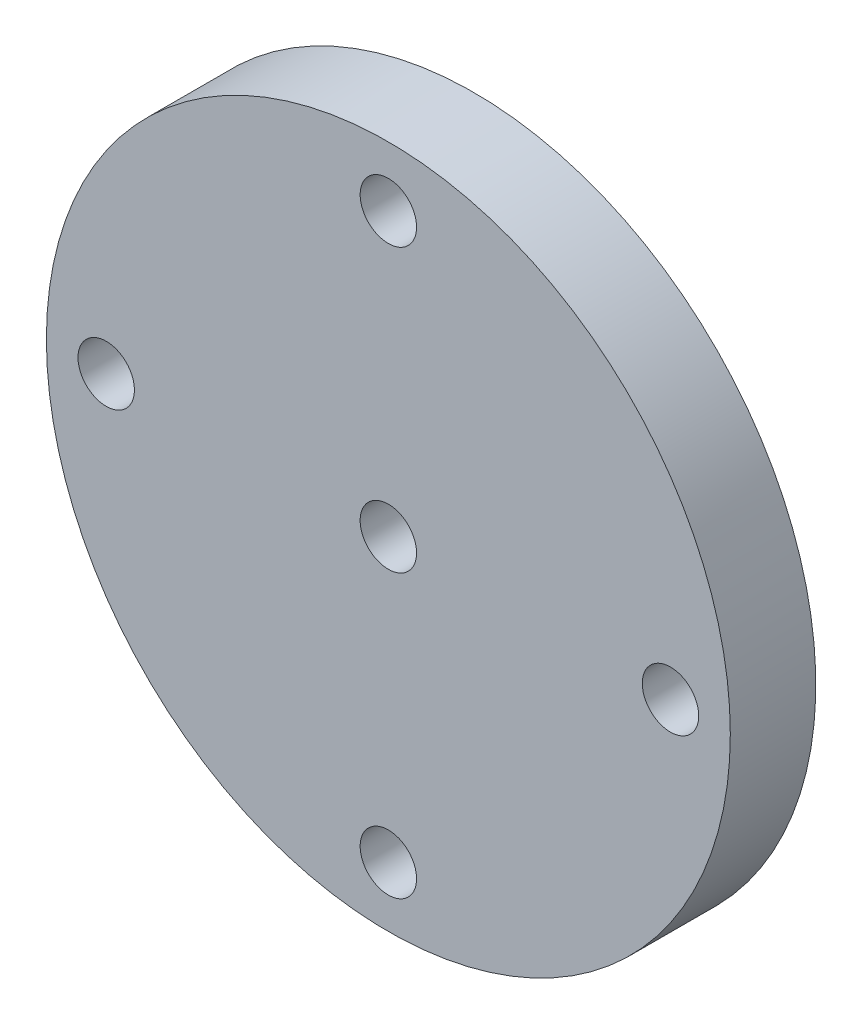
ISO-10303-21;
HEADER;
FILE_DESCRIPTION(('STEP AP214'),'2;1');
FILE_NAME('part.step','',(''),(''),'','','');
FILE_SCHEMA(('AUTOMOTIVE_DESIGN { 1 0 10303 214 1 1 1 1 }'));
ENDSEC;
DATA;
#1=APPLICATION_CONTEXT('core data for automotive mechanical design processes');
#2=APPLICATION_PROTOCOL_DEFINITION('international standard','automotive_design',2000,#1);
#3=PRODUCT_CONTEXT('',#1,'mechanical');
#4=PRODUCT('Part','Part','',(#3));
#5=PRODUCT_RELATED_PRODUCT_CATEGORY('part','',(#4));
#6=PRODUCT_DEFINITION_FORMATION('','',#4);
#7=PRODUCT_DEFINITION_CONTEXT('part definition',#1,'design');
#8=PRODUCT_DEFINITION('design','',#6,#7);
#9=PRODUCT_DEFINITION_SHAPE('','',#8);
#10=(LENGTH_UNIT() NAMED_UNIT(*) SI_UNIT(.MILLI.,.METRE.));
#11=(NAMED_UNIT(*) PLANE_ANGLE_UNIT() SI_UNIT($,.RADIAN.));
#12=(NAMED_UNIT(*) SI_UNIT($,.STERADIAN.) SOLID_ANGLE_UNIT());
#13=UNCERTAINTY_MEASURE_WITH_UNIT(LENGTH_MEASURE(1.E-05),#10,'distance_accuracy_value','');
#14=(GEOMETRIC_REPRESENTATION_CONTEXT(3) GLOBAL_UNCERTAINTY_ASSIGNED_CONTEXT((#13)) GLOBAL_UNIT_ASSIGNED_CONTEXT((#10,
#11,#12)) REPRESENTATION_CONTEXT('',''));
#15=CARTESIAN_POINT('',(0.,0.,0.));
#16=DIRECTION('',(0.,0.,1.));
#17=DIRECTION('',(1.,0.,0.));
#18=AXIS2_PLACEMENT_3D('',#15,#16,#17);
#19=CARTESIAN_POINT('',(0.,0.,10.));
#20=DIRECTION('',(0.,0.,-1.));
#21=DIRECTION('',(-1.,0.,0.));
#22=AXIS2_PLACEMENT_3D('',#19,#20,#21);
#23=CYLINDRICAL_SURFACE('',#22,20.);
#24=CARTESIAN_POINT('',(0.,0.,10.));
#25=DIRECTION('',(0.,0.,1.));
#26=DIRECTION('',(1.,0.,0.));
#27=AXIS2_PLACEMENT_3D('',#24,#25,#26);
#28=CIRCLE('',#27,20.);
#29=CARTESIAN_POINT('',(20.,0.,10.));
#30=VERTEX_POINT('',#29);
#31=EDGE_CURVE('E11',#30,#30,#28,.T.);
#32=ORIENTED_EDGE('',*,*,#31,.F.);
#33=EDGE_LOOP('',(#32));
#34=FACE_BOUND('',#33,.T.);
#35=CARTESIAN_POINT('',(0.,0.,5.));
#36=DIRECTION('',(0.,0.,-1.));
#37=DIRECTION('',(-1.,0.,0.));
#38=AXIS2_PLACEMENT_3D('',#35,#36,#37);
#39=CIRCLE('',#38,20.);
#40=CARTESIAN_POINT('',(-20.,0.,5.));
#41=VERTEX_POINT('',#40);
#42=EDGE_CURVE('E153',#41,#41,#39,.T.);
#43=ORIENTED_EDGE('',*,*,#42,.F.);
#44=EDGE_LOOP('',(#43));
#45=FACE_BOUND('',#44,.T.);
#46=ADVANCED_FACE('F39',(#34,#45),#23,.T.);
#47=CARTESIAN_POINT('',(0.,0.,0.));
#48=DIRECTION('',(0.,0.,1.));
#49=DIRECTION('',(1.,0.,0.));
#50=AXIS2_PLACEMENT_3D('',#47,#48,#49);
#51=PLANE('',#50);
#52=DIRECTION('',(1.,0.,0.));
#53=VECTOR('',#52,1.);
#54=CARTESIAN_POINT('',(5.,5.,0.));
#55=LINE('',#54,#53);
#56=CARTESIAN_POINT('',(-5.,5.,0.));
#57=VERTEX_POINT('',#56);
#58=CARTESIAN_POINT('',(5.,5.,0.));
#59=VERTEX_POINT('',#58);
#60=EDGE_CURVE('E88',#57,#59,#55,.T.);
#61=ORIENTED_EDGE('',*,*,#60,.F.);
#62=DIRECTION('',(0.,1.,0.));
#63=VECTOR('',#62,1.);
#64=CARTESIAN_POINT('',(-5.,-5.,0.));
#65=LINE('',#64,#63);
#66=CARTESIAN_POINT('',(-5.,-5.,0.));
#67=VERTEX_POINT('',#66);
#68=EDGE_CURVE('E54',#67,#57,#65,.T.);
#69=ORIENTED_EDGE('',*,*,#68,.F.);
#70=DIRECTION('',(-1.,0.,0.));
#71=VECTOR('',#70,1.);
#72=CARTESIAN_POINT('',(5.,-5.,0.));
#73=LINE('',#72,#71);
#74=CARTESIAN_POINT('',(5.,-5.,0.));
#75=VERTEX_POINT('',#74);
#76=EDGE_CURVE('E108',#75,#67,#73,.T.);
#77=ORIENTED_EDGE('',*,*,#76,.F.);
#78=DIRECTION('',(0.,-1.,0.));
#79=VECTOR('',#78,1.);
#80=CARTESIAN_POINT('',(5.,-5.,0.));
#81=LINE('',#80,#79);
#82=EDGE_CURVE('E119',#59,#75,#81,.T.);
#83=ORIENTED_EDGE('',*,*,#82,.F.);
#84=EDGE_LOOP('',(#61,#69,#77,#83));
#85=FACE_BOUND('',#84,.T.);
#86=CARTESIAN_POINT('',(0.,0.,0.));
#87=DIRECTION('',(0.,0.,-1.));
#88=DIRECTION('',(-1.,0.,0.));
#89=AXIS2_PLACEMENT_3D('',#86,#87,#88);
#90=CIRCLE('',#89,12.5);
#91=CARTESIAN_POINT('',(-12.5,0.,0.));
#92=VERTEX_POINT('',#91);
#93=EDGE_CURVE('E164',#92,#92,#90,.T.);
#94=ORIENTED_EDGE('',*,*,#93,.T.);
#95=EDGE_LOOP('',(#94));
#96=FACE_BOUND('',#95,.T.);
#97=ADVANCED_FACE('F129',(#85,#96),#51,.F.);
#98=CARTESIAN_POINT('',(0.,0.,10.));
#99=DIRECTION('',(0.,0.,1.));
#100=DIRECTION('',(1.,0.,0.));
#101=AXIS2_PLACEMENT_3D('',#98,#99,#100);
#102=PLANE('',#101);
#103=CARTESIAN_POINT('',(0.,16.5,10.));
#104=DIRECTION('',(0.,0.,-1.));
#105=DIRECTION('',(-1.,0.,0.));
#106=AXIS2_PLACEMENT_3D('',#103,#104,#105);
#107=CIRCLE('',#106,1.65);
#108=CARTESIAN_POINT('',(-1.65,16.5,10.));
#109=VERTEX_POINT('',#108);
#110=EDGE_CURVE('E208',#109,#109,#107,.T.);
#111=ORIENTED_EDGE('',*,*,#110,.T.);
#112=EDGE_LOOP('',(#111));
#113=FACE_BOUND('',#112,.T.);
#114=CARTESIAN_POINT('',(-16.5,0.,10.));
#115=DIRECTION('',(0.,0.,-1.));
#116=DIRECTION('',(-1.,0.,0.));
#117=AXIS2_PLACEMENT_3D('',#114,#115,#116);
#118=CIRCLE('',#117,1.65);
#119=CARTESIAN_POINT('',(-18.15,0.,10.));
#120=VERTEX_POINT('',#119);
#121=EDGE_CURVE('E221',#120,#120,#118,.T.);
#122=ORIENTED_EDGE('',*,*,#121,.T.);
#123=EDGE_LOOP('',(#122));
#124=FACE_BOUND('',#123,.T.);
#125=CARTESIAN_POINT('',(0.,-16.5,10.));
#126=DIRECTION('',(0.,0.,-1.));
#127=DIRECTION('',(-1.,0.,0.));
#128=AXIS2_PLACEMENT_3D('',#125,#126,#127);
#129=CIRCLE('',#128,1.65);
#130=CARTESIAN_POINT('',(-1.65,-16.5,10.));
#131=VERTEX_POINT('',#130);
#132=EDGE_CURVE('E229',#131,#131,#129,.T.);
#133=ORIENTED_EDGE('',*,*,#132,.T.);
#134=EDGE_LOOP('',(#133));
#135=FACE_BOUND('',#134,.T.);
#136=CARTESIAN_POINT('',(16.5,0.,10.));
#137=DIRECTION('',(0.,0.,-1.));
#138=DIRECTION('',(-1.,0.,0.));
#139=AXIS2_PLACEMENT_3D('',#136,#137,#138);
#140=CIRCLE('',#139,1.65);
#141=CARTESIAN_POINT('',(14.85,0.,10.));
#142=VERTEX_POINT('',#141);
#143=EDGE_CURVE('E237',#142,#142,#140,.T.);
#144=ORIENTED_EDGE('',*,*,#143,.T.);
#145=EDGE_LOOP('',(#144));
#146=FACE_BOUND('',#145,.T.);
#147=CARTESIAN_POINT('',(0.,0.,10.));
#148=DIRECTION('',(0.,0.,1.));
#149=DIRECTION('',(1.,0.,0.));
#150=AXIS2_PLACEMENT_3D('',#147,#148,#149);
#151=CIRCLE('',#150,1.64999999999999);
#152=CARTESIAN_POINT('',(1.64999999999999,0.,10.));
#153=VERTEX_POINT('',#152);
#154=EDGE_CURVE('E156',#153,#153,#151,.T.);
#155=ORIENTED_EDGE('',*,*,#154,.F.);
#156=EDGE_LOOP('',(#155));
#157=FACE_BOUND('',#156,.T.);
#158=ORIENTED_EDGE('',*,*,#31,.T.);
#159=EDGE_LOOP('',(#158));
#160=FACE_BOUND('',#159,.T.);
#161=ADVANCED_FACE('F141',(#113,#124,#135,#146,#157,#160),#102,.T.);
#162=CARTESIAN_POINT('',(-5.,-5.,5.));
#163=DIRECTION('',(-1.,0.,0.));
#164=DIRECTION('',(0.,0.,1.));
#165=AXIS2_PLACEMENT_3D('',#162,#163,#164);
#166=PLANE('',#165);
#167=ORIENTED_EDGE('',*,*,#68,.T.);
#168=DIRECTION('',(0.,0.,-1.));
#169=VECTOR('',#168,1.);
#170=CARTESIAN_POINT('',(-5.,5.,5.));
#171=LINE('',#170,#169);
#172=CARTESIAN_POINT('',(-5.,5.,5.));
#173=VERTEX_POINT('',#172);
#174=EDGE_CURVE('E76',#173,#57,#171,.T.);
#175=ORIENTED_EDGE('',*,*,#174,.F.);
#176=DIRECTION('',(0.,1.,0.));
#177=VECTOR('',#176,1.);
#178=CARTESIAN_POINT('',(-5.,-5.,5.));
#179=LINE('',#178,#177);
#180=CARTESIAN_POINT('',(-5.,-5.,5.));
#181=VERTEX_POINT('',#180);
#182=EDGE_CURVE('E104',#181,#173,#179,.T.);
#183=ORIENTED_EDGE('',*,*,#182,.F.);
#184=DIRECTION('',(0.,0.,-1.));
#185=VECTOR('',#184,1.);
#186=CARTESIAN_POINT('',(-5.,-5.,5.));
#187=LINE('',#186,#185);
#188=EDGE_CURVE('E47',#181,#67,#187,.T.);
#189=ORIENTED_EDGE('',*,*,#188,.T.);
#190=EDGE_LOOP('',(#167,#175,#183,#189));
#191=FACE_BOUND('',#190,.T.);
#192=ADVANCED_FACE('F134',(#191),#166,.F.);
#193=CARTESIAN_POINT('',(5.,-5.,5.));
#194=DIRECTION('',(0.,-1.,0.));
#195=DIRECTION('',(0.,0.,-1.));
#196=AXIS2_PLACEMENT_3D('',#193,#194,#195);
#197=PLANE('',#196);
#198=ORIENTED_EDGE('',*,*,#76,.T.);
#199=ORIENTED_EDGE('',*,*,#188,.F.);
#200=DIRECTION('',(-1.,0.,0.));
#201=VECTOR('',#200,1.);
#202=CARTESIAN_POINT('',(5.,-5.,5.));
#203=LINE('',#202,#201);
#204=CARTESIAN_POINT('',(5.,-5.,5.));
#205=VERTEX_POINT('',#204);
#206=EDGE_CURVE('E101',#205,#181,#203,.T.);
#207=ORIENTED_EDGE('',*,*,#206,.F.);
#208=DIRECTION('',(0.,0.,-1.));
#209=VECTOR('',#208,1.);
#210=CARTESIAN_POINT('',(5.,-5.,5.));
#211=LINE('',#210,#209);
#212=EDGE_CURVE('E93',#205,#75,#211,.T.);
#213=ORIENTED_EDGE('',*,*,#212,.T.);
#214=EDGE_LOOP('',(#198,#199,#207,#213));
#215=FACE_BOUND('',#214,.T.);
#216=ADVANCED_FACE('F132',(#215),#197,.F.);
#217=CARTESIAN_POINT('',(5.,-5.,5.));
#218=DIRECTION('',(1.,0.,0.));
#219=DIRECTION('',(0.,0.,-1.));
#220=AXIS2_PLACEMENT_3D('',#217,#218,#219);
#221=PLANE('',#220);
#222=ORIENTED_EDGE('',*,*,#82,.T.);
#223=ORIENTED_EDGE('',*,*,#212,.F.);
#224=DIRECTION('',(0.,-1.,0.));
#225=VECTOR('',#224,1.);
#226=CARTESIAN_POINT('',(5.,-5.,5.));
#227=LINE('',#226,#225);
#228=CARTESIAN_POINT('',(5.,5.,5.));
#229=VERTEX_POINT('',#228);
#230=EDGE_CURVE('E96',#229,#205,#227,.T.);
#231=ORIENTED_EDGE('',*,*,#230,.F.);
#232=DIRECTION('',(0.,0.,-1.));
#233=VECTOR('',#232,1.);
#234=CARTESIAN_POINT('',(5.,5.,5.));
#235=LINE('',#234,#233);
#236=EDGE_CURVE('E81',#229,#59,#235,.T.);
#237=ORIENTED_EDGE('',*,*,#236,.T.);
#238=EDGE_LOOP('',(#222,#223,#231,#237));
#239=FACE_BOUND('',#238,.T.);
#240=ADVANCED_FACE('F97',(#239),#221,.F.);
#241=CARTESIAN_POINT('',(5.,5.,5.));
#242=DIRECTION('',(0.,1.,0.));
#243=DIRECTION('',(0.,0.,1.));
#244=AXIS2_PLACEMENT_3D('',#241,#242,#243);
#245=PLANE('',#244);
#246=ORIENTED_EDGE('',*,*,#60,.T.);
#247=ORIENTED_EDGE('',*,*,#236,.F.);
#248=DIRECTION('',(1.,0.,0.));
#249=VECTOR('',#248,1.);
#250=CARTESIAN_POINT('',(5.,5.,5.));
#251=LINE('',#250,#249);
#252=EDGE_CURVE('E85',#173,#229,#251,.T.);
#253=ORIENTED_EDGE('',*,*,#252,.F.);
#254=ORIENTED_EDGE('',*,*,#174,.T.);
#255=EDGE_LOOP('',(#246,#247,#253,#254));
#256=FACE_BOUND('',#255,.T.);
#257=ADVANCED_FACE('F83',(#256),#245,.F.);
#258=CARTESIAN_POINT('',(0.,0.,5.));
#259=DIRECTION('',(0.,0.,1.));
#260=DIRECTION('',(1.,0.,0.));
#261=AXIS2_PLACEMENT_3D('',#258,#259,#260);
#262=PLANE('',#261);
#263=CARTESIAN_POINT('',(0.,0.,5.));
#264=DIRECTION('',(0.,0.,1.));
#265=DIRECTION('',(1.,0.,0.));
#266=AXIS2_PLACEMENT_3D('',#263,#264,#265);
#267=CIRCLE('',#266,1.64999999999999);
#268=CARTESIAN_POINT('',(1.64999999999999,0.,5.));
#269=VERTEX_POINT('',#268);
#270=EDGE_CURVE('E116',#269,#269,#267,.T.);
#271=ORIENTED_EDGE('',*,*,#270,.T.);
#272=EDGE_LOOP('',(#271));
#273=FACE_BOUND('',#272,.T.);
#274=ORIENTED_EDGE('',*,*,#182,.T.);
#275=ORIENTED_EDGE('',*,*,#252,.T.);
#276=ORIENTED_EDGE('',*,*,#230,.T.);
#277=ORIENTED_EDGE('',*,*,#206,.T.);
#278=EDGE_LOOP('',(#274,#275,#276,#277));
#279=FACE_BOUND('',#278,.T.);
#280=ADVANCED_FACE('F103',(#273,#279),#262,.F.);
#281=CARTESIAN_POINT('',(0.,0.,10.));
#282=DIRECTION('',(0.,0.,1.));
#283=DIRECTION('',(1.,0.,0.));
#284=AXIS2_PLACEMENT_3D('',#281,#282,#283);
#285=CYLINDRICAL_SURFACE('',#284,1.64999999999999);
#286=ORIENTED_EDGE('',*,*,#154,.T.);
#287=EDGE_LOOP('',(#286));
#288=FACE_BOUND('',#287,.T.);
#289=ORIENTED_EDGE('',*,*,#270,.F.);
#290=EDGE_LOOP('',(#289));
#291=FACE_BOUND('',#290,.T.);
#292=ADVANCED_FACE('F172',(#288,#291),#285,.F.);
#293=CARTESIAN_POINT('',(0.,0.,5.));
#294=DIRECTION('',(0.,0.,-1.));
#295=DIRECTION('',(-1.,0.,0.));
#296=AXIS2_PLACEMENT_3D('',#293,#294,#295);
#297=PLANE('',#296);
#298=CARTESIAN_POINT('',(0.,16.5,5.));
#299=DIRECTION('',(0.,0.,-1.));
#300=DIRECTION('',(-1.,0.,0.));
#301=AXIS2_PLACEMENT_3D('',#298,#299,#300);
#302=CIRCLE('',#301,1.64999999999999);
#303=CARTESIAN_POINT('',(-1.64999999999999,16.5,5.));
#304=VERTEX_POINT('',#303);
#305=EDGE_CURVE('E211',#304,#304,#302,.T.);
#306=ORIENTED_EDGE('',*,*,#305,.F.);
#307=EDGE_LOOP('',(#306));
#308=FACE_BOUND('',#307,.T.);
#309=CARTESIAN_POINT('',(-16.5,0.,5.));
#310=DIRECTION('',(0.,0.,-1.));
#311=DIRECTION('',(-1.,0.,0.));
#312=AXIS2_PLACEMENT_3D('',#309,#310,#311);
#313=CIRCLE('',#312,1.64999999999999);
#314=CARTESIAN_POINT('',(-18.15,0.,5.));
#315=VERTEX_POINT('',#314);
#316=EDGE_CURVE('E215',#315,#315,#313,.T.);
#317=ORIENTED_EDGE('',*,*,#316,.F.);
#318=EDGE_LOOP('',(#317));
#319=FACE_BOUND('',#318,.T.);
#320=CARTESIAN_POINT('',(0.,-16.5,5.));
#321=DIRECTION('',(0.,0.,-1.));
#322=DIRECTION('',(-1.,0.,0.));
#323=AXIS2_PLACEMENT_3D('',#320,#321,#322);
#324=CIRCLE('',#323,1.64999999999999);
#325=CARTESIAN_POINT('',(-1.64999999999999,-16.5,5.));
#326=VERTEX_POINT('',#325);
#327=EDGE_CURVE('E225',#326,#326,#324,.T.);
#328=ORIENTED_EDGE('',*,*,#327,.F.);
#329=EDGE_LOOP('',(#328));
#330=FACE_BOUND('',#329,.T.);
#331=CARTESIAN_POINT('',(16.5,0.,5.));
#332=DIRECTION('',(0.,0.,-1.));
#333=DIRECTION('',(-1.,0.,0.));
#334=AXIS2_PLACEMENT_3D('',#331,#332,#333);
#335=CIRCLE('',#334,1.64999999999999);
#336=CARTESIAN_POINT('',(14.85,0.,5.));
#337=VERTEX_POINT('',#336);
#338=EDGE_CURVE('E233',#337,#337,#335,.T.);
#339=ORIENTED_EDGE('',*,*,#338,.F.);
#340=EDGE_LOOP('',(#339));
#341=FACE_BOUND('',#340,.T.);
#342=CARTESIAN_POINT('',(0.,0.,5.));
#343=DIRECTION('',(0.,0.,-1.));
#344=DIRECTION('',(-1.,0.,0.));
#345=AXIS2_PLACEMENT_3D('',#342,#343,#344);
#346=CIRCLE('',#345,12.5);
#347=CARTESIAN_POINT('',(-12.5,0.,5.));
#348=VERTEX_POINT('',#347);
#349=EDGE_CURVE('E157',#348,#348,#346,.T.);
#350=ORIENTED_EDGE('',*,*,#349,.F.);
#351=EDGE_LOOP('',(#350));
#352=FACE_BOUND('',#351,.T.);
#353=ORIENTED_EDGE('',*,*,#42,.T.);
#354=EDGE_LOOP('',(#353));
#355=FACE_BOUND('',#354,.T.);
#356=ADVANCED_FACE('F174',(#308,#319,#330,#341,#352,#355),#297,.T.);
#357=CARTESIAN_POINT('',(0.,0.,5.));
#358=DIRECTION('',(0.,0.,-1.));
#359=DIRECTION('',(-1.,0.,0.));
#360=AXIS2_PLACEMENT_3D('',#357,#358,#359);
#361=CYLINDRICAL_SURFACE('',#360,12.5);
#362=ORIENTED_EDGE('',*,*,#349,.T.);
#363=EDGE_LOOP('',(#362));
#364=FACE_BOUND('',#363,.T.);
#365=ORIENTED_EDGE('',*,*,#93,.F.);
#366=EDGE_LOOP('',(#365));
#367=FACE_BOUND('',#366,.T.);
#368=ADVANCED_FACE('F181',(#364,#367),#361,.T.);
#369=CARTESIAN_POINT('',(16.5,0.,5.));
#370=DIRECTION('',(0.,0.,-1.));
#371=DIRECTION('',(-1.,0.,0.));
#372=AXIS2_PLACEMENT_3D('',#369,#370,#371);
#373=CYLINDRICAL_SURFACE('',#372,1.64999999999999);
#374=ORIENTED_EDGE('',*,*,#143,.F.);
#375=EDGE_LOOP('',(#374));
#376=FACE_BOUND('',#375,.T.);
#377=ORIENTED_EDGE('',*,*,#338,.T.);
#378=EDGE_LOOP('',(#377));
#379=FACE_BOUND('',#378,.T.);
#380=ADVANCED_FACE('F187',(#376,#379),#373,.F.);
#381=CARTESIAN_POINT('',(0.,-16.5,5.));
#382=DIRECTION('',(0.,0.,-1.));
#383=DIRECTION('',(-1.,0.,0.));
#384=AXIS2_PLACEMENT_3D('',#381,#382,#383);
#385=CYLINDRICAL_SURFACE('',#384,1.64999999999999);
#386=ORIENTED_EDGE('',*,*,#132,.F.);
#387=EDGE_LOOP('',(#386));
#388=FACE_BOUND('',#387,.T.);
#389=ORIENTED_EDGE('',*,*,#327,.T.);
#390=EDGE_LOOP('',(#389));
#391=FACE_BOUND('',#390,.T.);
#392=ADVANCED_FACE('F191',(#388,#391),#385,.F.);
#393=CARTESIAN_POINT('',(-16.5,0.,5.));
#394=DIRECTION('',(0.,0.,-1.));
#395=DIRECTION('',(-1.,0.,0.));
#396=AXIS2_PLACEMENT_3D('',#393,#394,#395);
#397=CYLINDRICAL_SURFACE('',#396,1.64999999999999);
#398=ORIENTED_EDGE('',*,*,#121,.F.);
#399=EDGE_LOOP('',(#398));
#400=FACE_BOUND('',#399,.T.);
#401=ORIENTED_EDGE('',*,*,#316,.T.);
#402=EDGE_LOOP('',(#401));
#403=FACE_BOUND('',#402,.T.);
#404=ADVANCED_FACE('F195',(#400,#403),#397,.F.);
#405=CARTESIAN_POINT('',(0.,16.5,5.));
#406=DIRECTION('',(0.,0.,-1.));
#407=DIRECTION('',(-1.,0.,0.));
#408=AXIS2_PLACEMENT_3D('',#405,#406,#407);
#409=CYLINDRICAL_SURFACE('',#408,1.64999999999999);
#410=ORIENTED_EDGE('',*,*,#110,.F.);
#411=EDGE_LOOP('',(#410));
#412=FACE_BOUND('',#411,.T.);
#413=ORIENTED_EDGE('',*,*,#305,.T.);
#414=EDGE_LOOP('',(#413));
#415=FACE_BOUND('',#414,.T.);
#416=ADVANCED_FACE('F199',(#412,#415),#409,.F.);
#417=CLOSED_SHELL('',(#46,#97,#161,#192,#216,#240,#257,#280,#292,#356,#368,#380,#392,#404,#416));
#418=MANIFOLD_SOLID_BREP('B2',#417);
#419=ADVANCED_BREP_SHAPE_REPRESENTATION('',(#18,#418),#14);
#420=SHAPE_DEFINITION_REPRESENTATION(#9,#419);
ENDSEC;
END-ISO-10303-21;
